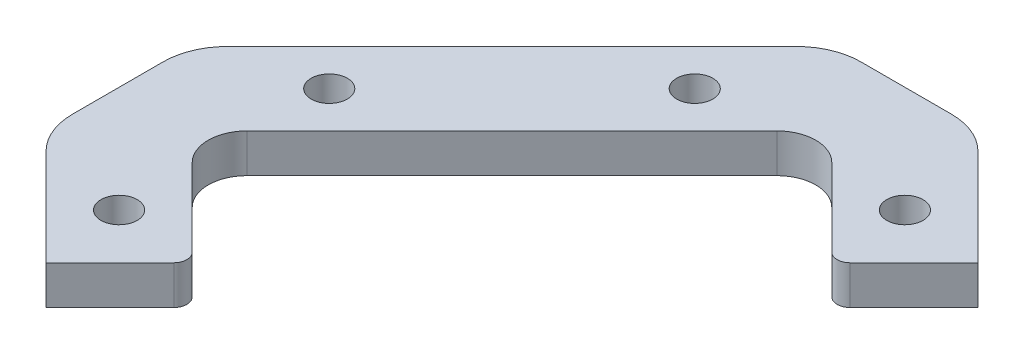
ISO-10303-21;
HEADER;
FILE_DESCRIPTION(('STEP AP214'),'2;1');
FILE_NAME('part.step','',(''),(''),'','','');
FILE_SCHEMA(('AUTOMOTIVE_DESIGN { 1 0 10303 214 1 1 1 1 }'));
ENDSEC;
DATA;
#1=APPLICATION_CONTEXT('core data for automotive mechanical design processes');
#2=APPLICATION_PROTOCOL_DEFINITION('international standard','automotive_design',2000,#1);
#3=PRODUCT_CONTEXT('',#1,'mechanical');
#4=PRODUCT('Part','Part','',(#3));
#5=PRODUCT_RELATED_PRODUCT_CATEGORY('part','',(#4));
#6=PRODUCT_DEFINITION_FORMATION('','',#4);
#7=PRODUCT_DEFINITION_CONTEXT('part definition',#1,'design');
#8=PRODUCT_DEFINITION('design','',#6,#7);
#9=PRODUCT_DEFINITION_SHAPE('','',#8);
#10=(LENGTH_UNIT() NAMED_UNIT(*) SI_UNIT(.MILLI.,.METRE.));
#11=(NAMED_UNIT(*) PLANE_ANGLE_UNIT() SI_UNIT($,.RADIAN.));
#12=(NAMED_UNIT(*) SI_UNIT($,.STERADIAN.) SOLID_ANGLE_UNIT());
#13=UNCERTAINTY_MEASURE_WITH_UNIT(LENGTH_MEASURE(1.E-05),#10,'distance_accuracy_value','');
#14=(GEOMETRIC_REPRESENTATION_CONTEXT(3) GLOBAL_UNCERTAINTY_ASSIGNED_CONTEXT((#13)) GLOBAL_UNIT_ASSIGNED_CONTEXT((#10,
#11,#12)) REPRESENTATION_CONTEXT('',''));
#15=CARTESIAN_POINT('',(0.,0.,0.));
#16=DIRECTION('',(0.,0.,1.));
#17=DIRECTION('',(1.,0.,0.));
#18=AXIS2_PLACEMENT_3D('',#15,#16,#17);
#19=CARTESIAN_POINT('',(-6.74456057212033,3.,14.6317901941447));
#20=DIRECTION('',(0.,1.,0.));
#21=DIRECTION('',(0.,0.,1.));
#22=AXIS2_PLACEMENT_3D('',#19,#20,#21);
#23=PLANE('',#22);
#24=CARTESIAN_POINT('',(-11.6943080404259,3.,-2.33877255433241));
#25=DIRECTION('',(0.,1.,0.));
#26=DIRECTION('',(0.,0.,1.));
#27=AXIS2_PLACEMENT_3D('',#24,#25,#26);
#28=CIRCLE('',#27,1.4);
#29=CARTESIAN_POINT('',(-11.6943080404259,3.,-0.938772554332412));
#30=VERTEX_POINT('',#29);
#31=EDGE_CURVE('E434',#30,#30,#28,.T.);
#32=ORIENTED_EDGE('',*,*,#31,.F.);
#33=EDGE_LOOP('',(#32));
#34=FACE_BOUND('',#33,.T.);
#35=CARTESIAN_POINT('',(18.7112835505958,3.,-16.480908178063));
#36=DIRECTION('',(0.,1.,0.));
#37=DIRECTION('',(0.,0.,1.));
#38=AXIS2_PLACEMENT_3D('',#35,#36,#37);
#39=CIRCLE('',#38,1.4);
#40=CARTESIAN_POINT('',(18.7112835505958,3.,-15.080908178063));
#41=VERTEX_POINT('',#40);
#42=EDGE_CURVE('E212',#41,#41,#39,.T.);
#43=ORIENTED_EDGE('',*,*,#42,.F.);
#44=EDGE_LOOP('',(#43));
#45=FACE_BOUND('',#44,.T.);
#46=CARTESIAN_POINT('',(-6.74456057212033,3.,14.6317901941447));
#47=DIRECTION('',(0.,1.,0.));
#48=DIRECTION('',(0.,0.,1.));
#49=AXIS2_PLACEMENT_3D('',#46,#47,#48);
#50=CIRCLE('',#49,0.999999999999965);
#51=CARTESIAN_POINT('',(-6.03745379093385,3.,15.3388969753312));
#52=VERTEX_POINT('',#51);
#53=CARTESIAN_POINT('',(-6.03745379093376,3.,13.9246834129581));
#54=VERTEX_POINT('',#53);
#55=EDGE_CURVE('E260',#52,#54,#50,.T.);
#56=ORIENTED_EDGE('',*,*,#55,.T.);
#57=DIRECTION('',(-0.707106781186548,0.,-0.707106781186548));
#58=VECTOR('',#57,1.);
#59=CARTESIAN_POINT('',(-6.03745379093376,3.,13.9246834129581));
#60=LINE('',#59,#58);
#61=CARTESIAN_POINT('',(-12.0478614310193,3.,7.91427577287255));
#62=VERTEX_POINT('',#61);
#63=EDGE_CURVE('E136',#54,#62,#60,.T.);
#64=ORIENTED_EDGE('',*,*,#63,.T.);
#65=CARTESIAN_POINT('',(-9.92654108745964,3.,5.7929554293129));
#66=DIRECTION('',(0.,-1.,0.));
#67=DIRECTION('',(0.,0.,1.));
#68=AXIS2_PLACEMENT_3D('',#65,#66,#67);
#69=CIRCLE('',#68,3.);
#70=CARTESIAN_POINT('',(-12.0478614310193,3.,3.67163508575328));
#71=VERTEX_POINT('',#70);
#72=EDGE_CURVE('E321',#62,#71,#69,.T.);
#73=ORIENTED_EDGE('',*,*,#72,.T.);
#74=DIRECTION('',(0.707106781186547,0.,-0.707106781186547));
#75=VECTOR('',#74,1.);
#76=CARTESIAN_POINT('',(-12.0478614310193,3.,3.67163508575328));
#77=LINE('',#76,#75);
#78=CARTESIAN_POINT('',(8.45823522339074,3.,-16.8344615686565));
#79=VERTEX_POINT('',#78);
#80=EDGE_CURVE('E341',#71,#79,#77,.T.);
#81=ORIENTED_EDGE('',*,*,#80,.T.);
#82=CARTESIAN_POINT('',(10.5795555669505,3.,-14.7131412250968));
#83=DIRECTION('',(0.,-1.,0.));
#84=DIRECTION('',(0.,0.,1.));
#85=AXIS2_PLACEMENT_3D('',#82,#83,#84);
#86=CIRCLE('',#85,3.00000000000011);
#87=CARTESIAN_POINT('',(12.7008759105101,3.,-16.8344615686564));
#88=VERTEX_POINT('',#87);
#89=EDGE_CURVE('E337',#79,#88,#86,.T.);
#90=ORIENTED_EDGE('',*,*,#89,.T.);
#91=DIRECTION('',(0.707106781186548,0.,0.707106781186548));
#92=VECTOR('',#91,1.);
#93=CARTESIAN_POINT('',(12.7008759105101,3.,-16.8344615686564));
#94=LINE('',#93,#92);
#95=CARTESIAN_POINT('',(18.7112835505957,3.,-10.8240539285707));
#96=VERTEX_POINT('',#95);
#97=EDGE_CURVE('E340',#88,#96,#94,.T.);
#98=ORIENTED_EDGE('',*,*,#97,.T.);
#99=CARTESIAN_POINT('',(19.4183903317823,3.,-11.5311607097572));
#100=DIRECTION('',(0.,1.,0.));
#101=DIRECTION('',(0.,0.,1.));
#102=AXIS2_PLACEMENT_3D('',#99,#100,#101);
#103=CIRCLE('',#102,0.999999999999948);
#104=CARTESIAN_POINT('',(20.1254971129688,3.,-10.8240539285707));
#105=VERTEX_POINT('',#104);
#106=EDGE_CURVE('E345',#96,#105,#103,.T.);
#107=ORIENTED_EDGE('',*,*,#106,.T.);
#108=DIRECTION('',(0.707106781186548,0.,-0.707106781186547));
#109=VECTOR('',#108,1.);
#110=CARTESIAN_POINT('',(20.1254971129688,3.,-10.8240539285707));
#111=LINE('',#110,#109);
#112=CARTESIAN_POINT('',(25.0752445812746,3.,-15.7738013968765));
#113=VERTEX_POINT('',#112);
#114=EDGE_CURVE('E352',#105,#113,#111,.T.);
#115=ORIENTED_EDGE('',*,*,#114,.T.);
#116=DIRECTION('',(-0.707106781186547,0.,-0.707106781186547));
#117=VECTOR('',#116,1.);
#118=CARTESIAN_POINT('',(25.0752445812746,3.,-15.7738013968765));
#119=LINE('',#118,#117);
#120=CARTESIAN_POINT('',(17.6064675015317,3.,-23.2425784766195));
#121=VERTEX_POINT('',#120);
#122=EDGE_CURVE('E355',#113,#121,#119,.T.);
#123=ORIENTED_EDGE('',*,*,#122,.T.);
#124=CARTESIAN_POINT('',(14.070933595599,3.,-19.7070445706869));
#125=DIRECTION('',(0.,1.,0.));
#126=DIRECTION('',(0.,0.,1.));
#127=AXIS2_PLACEMENT_3D('',#124,#125,#126);
#128=CIRCLE('',#127,4.99999999999992);
#129=CARTESIAN_POINT('',(14.070933595599,3.,-24.7070445706869));
#130=VERTEX_POINT('',#129);
#131=EDGE_CURVE('E358',#121,#130,#128,.T.);
#132=ORIENTED_EDGE('',*,*,#131,.T.);
#133=DIRECTION('',(-1.,0.,0.));
#134=VECTOR('',#133,1.);
#135=CARTESIAN_POINT('',(14.070933595599,3.,-24.7070445706869));
#136=LINE('',#135,#134);
#137=CARTESIAN_POINT('',(7.08817753830206,3.,-24.7070445706869));
#138=VERTEX_POINT('',#137);
#139=EDGE_CURVE('E361',#130,#138,#136,.T.);
#140=ORIENTED_EDGE('',*,*,#139,.T.);
#141=CARTESIAN_POINT('',(7.08817753830201,3.,-19.7070445706869));
#142=DIRECTION('',(0.,1.,0.));
#143=DIRECTION('',(0.,0.,1.));
#144=AXIS2_PLACEMENT_3D('',#141,#142,#143);
#145=CIRCLE('',#144,4.99999999999995);
#146=CARTESIAN_POINT('',(3.5526436323693,3.,-23.2425784766196));
#147=VERTEX_POINT('',#146);
#148=EDGE_CURVE('E364',#138,#147,#145,.T.);
#149=ORIENTED_EDGE('',*,*,#148,.T.);
#150=DIRECTION('',(-0.707106781186547,0.,0.707106781186547));
#151=VECTOR('',#150,1.);
#152=CARTESIAN_POINT('',(3.5526436323693,3.,-23.2425784766196));
#153=LINE('',#152,#151);
#154=CARTESIAN_POINT('',(-18.4559783389823,3.,-1.23395650526831));
#155=VERTEX_POINT('',#154);
#156=EDGE_CURVE('E367',#147,#155,#153,.T.);
#157=ORIENTED_EDGE('',*,*,#156,.T.);
#158=CARTESIAN_POINT('',(-14.9204444330497,3.,2.30157740066436));
#159=DIRECTION('',(0.,1.,0.));
#160=DIRECTION('',(0.,0.,1.));
#161=AXIS2_PLACEMENT_3D('',#158,#159,#160);
#162=CIRCLE('',#161,4.99999999999983);
#163=CARTESIAN_POINT('',(-19.9204444330497,3.,2.30157740066436));
#164=VERTEX_POINT('',#163);
#165=EDGE_CURVE('E370',#155,#164,#162,.T.);
#166=ORIENTED_EDGE('',*,*,#165,.T.);
#167=DIRECTION('',(0.,0.,1.));
#168=VECTOR('',#167,1.);
#169=CARTESIAN_POINT('',(-19.9204444330497,3.,2.30157740066436));
#170=LINE('',#169,#168);
#171=CARTESIAN_POINT('',(-19.9204444330497,3.,9.28433345796131));
#172=VERTEX_POINT('',#171);
#173=EDGE_CURVE('E185',#164,#172,#170,.T.);
#174=ORIENTED_EDGE('',*,*,#173,.T.);
#175=CARTESIAN_POINT('',(-14.9204444330498,3.,9.28433345796136));
#176=DIRECTION('',(0.,1.,0.));
#177=DIRECTION('',(0.,0.,1.));
#178=AXIS2_PLACEMENT_3D('',#175,#176,#177);
#179=CIRCLE('',#178,4.99999999999995);
#180=CARTESIAN_POINT('',(-18.4559783389825,3.,12.8198673638941));
#181=VERTEX_POINT('',#180);
#182=EDGE_CURVE('E179',#172,#181,#179,.T.);
#183=ORIENTED_EDGE('',*,*,#182,.T.);
#184=DIRECTION('',(0.707106781186548,0.,0.707106781186547));
#185=VECTOR('',#184,1.);
#186=CARTESIAN_POINT('',(-18.4559783389825,3.,12.8198673638941));
#187=LINE('',#186,#185);
#188=CARTESIAN_POINT('',(-10.9872012592396,3.,20.2886444436369));
#189=VERTEX_POINT('',#188);
#190=EDGE_CURVE('E183',#181,#189,#187,.T.);
#191=ORIENTED_EDGE('',*,*,#190,.T.);
#192=DIRECTION('',(0.707106781186547,0.,-0.707106781186547));
#193=VECTOR('',#192,1.);
#194=CARTESIAN_POINT('',(-10.9872012592396,3.,20.2886444436369));
#195=LINE('',#194,#193);
#196=EDGE_CURVE('E63',#189,#52,#195,.T.);
#197=ORIENTED_EDGE('',*,*,#196,.T.);
#198=EDGE_LOOP('',(#56,#64,#73,#81,#90,#98,#107,#115,#123,#132,#140,#149,#157,#166,#174,#183,
#191,#197));
#199=FACE_BOUND('',#198,.T.);
#200=CARTESIAN_POINT('',(2.44782758330519,3.,-16.4809081780633));
#201=DIRECTION('',(0.,1.,0.));
#202=DIRECTION('',(0.,0.,1.));
#203=AXIS2_PLACEMENT_3D('',#200,#201,#202);
#204=CIRCLE('',#203,1.4);
#205=CARTESIAN_POINT('',(2.44782758330519,3.,-15.0809081780633));
#206=VERTEX_POINT('',#205);
#207=EDGE_CURVE('E442',#206,#206,#204,.T.);
#208=ORIENTED_EDGE('',*,*,#207,.F.);
#209=EDGE_LOOP('',(#208));
#210=FACE_BOUND('',#209,.T.);
#211=CARTESIAN_POINT('',(-11.694308040426,3.,13.9246834129582));
#212=DIRECTION('',(0.,1.,0.));
#213=DIRECTION('',(0.,0.,1.));
#214=AXIS2_PLACEMENT_3D('',#211,#212,#213);
#215=CIRCLE('',#214,1.4);
#216=CARTESIAN_POINT('',(-11.694308040426,3.,15.3246834129582));
#217=VERTEX_POINT('',#216);
#218=EDGE_CURVE('E423',#217,#217,#215,.T.);
#219=ORIENTED_EDGE('',*,*,#218,.F.);
#220=EDGE_LOOP('',(#219));
#221=FACE_BOUND('',#220,.T.);
#222=ADVANCED_FACE('F45',(#34,#45,#199,#210,#221),#23,.T.);
#223=CARTESIAN_POINT('',(-6.74456057212033,0.,14.6317901941447));
#224=DIRECTION('',(0.,1.,0.));
#225=DIRECTION('',(0.,0.,1.));
#226=AXIS2_PLACEMENT_3D('',#223,#224,#225);
#227=PLANE('',#226);
#228=CARTESIAN_POINT('',(-6.74456057212033,0.,14.6317901941447));
#229=DIRECTION('',(0.,1.,0.));
#230=DIRECTION('',(0.,0.,1.));
#231=AXIS2_PLACEMENT_3D('',#228,#229,#230);
#232=CIRCLE('',#231,0.999999999999965);
#233=CARTESIAN_POINT('',(-6.03745379093385,0.,15.3388969753312));
#234=VERTEX_POINT('',#233);
#235=CARTESIAN_POINT('',(-6.03745379093376,0.,13.9246834129581));
#236=VERTEX_POINT('',#235);
#237=EDGE_CURVE('E207',#234,#236,#232,.T.);
#238=ORIENTED_EDGE('',*,*,#237,.F.);
#239=DIRECTION('',(0.707106781186547,0.,-0.707106781186547));
#240=VECTOR('',#239,1.);
#241=CARTESIAN_POINT('',(-10.9872012592396,0.,20.2886444436369));
#242=LINE('',#241,#240);
#243=CARTESIAN_POINT('',(-10.9872012592396,0.,20.2886444436369));
#244=VERTEX_POINT('',#243);
#245=EDGE_CURVE('E128',#244,#234,#242,.T.);
#246=ORIENTED_EDGE('',*,*,#245,.F.);
#247=DIRECTION('',(0.707106781186548,0.,0.707106781186547));
#248=VECTOR('',#247,1.);
#249=CARTESIAN_POINT('',(-18.4559783389825,0.,12.8198673638941));
#250=LINE('',#249,#248);
#251=CARTESIAN_POINT('',(-18.4559783389825,0.,12.8198673638941));
#252=VERTEX_POINT('',#251);
#253=EDGE_CURVE('E122',#252,#244,#250,.T.);
#254=ORIENTED_EDGE('',*,*,#253,.F.);
#255=CARTESIAN_POINT('',(-14.9204444330498,0.,9.28433345796136));
#256=DIRECTION('',(0.,1.,0.));
#257=DIRECTION('',(0.,0.,1.));
#258=AXIS2_PLACEMENT_3D('',#255,#256,#257);
#259=CIRCLE('',#258,4.99999999999995);
#260=CARTESIAN_POINT('',(-19.9204444330497,0.,9.28433345796131));
#261=VERTEX_POINT('',#260);
#262=EDGE_CURVE('E194',#261,#252,#259,.T.);
#263=ORIENTED_EDGE('',*,*,#262,.F.);
#264=DIRECTION('',(0.,0.,1.));
#265=VECTOR('',#264,1.);
#266=CARTESIAN_POINT('',(-19.9204444330497,0.,2.30157740066436));
#267=LINE('',#266,#265);
#268=CARTESIAN_POINT('',(-19.9204444330497,0.,2.30157740066436));
#269=VERTEX_POINT('',#268);
#270=EDGE_CURVE('E251',#269,#261,#267,.T.);
#271=ORIENTED_EDGE('',*,*,#270,.F.);
#272=CARTESIAN_POINT('',(-14.9204444330497,0.,2.30157740066436));
#273=DIRECTION('',(0.,1.,0.));
#274=DIRECTION('',(0.,0.,1.));
#275=AXIS2_PLACEMENT_3D('',#272,#273,#274);
#276=CIRCLE('',#275,4.99999999999983);
#277=CARTESIAN_POINT('',(-18.4559783389823,0.,-1.23395650526831));
#278=VERTEX_POINT('',#277);
#279=EDGE_CURVE('E248',#278,#269,#276,.T.);
#280=ORIENTED_EDGE('',*,*,#279,.F.);
#281=DIRECTION('',(-0.707106781186547,0.,0.707106781186547));
#282=VECTOR('',#281,1.);
#283=CARTESIAN_POINT('',(3.5526436323693,0.,-23.2425784766196));
#284=LINE('',#283,#282);
#285=CARTESIAN_POINT('',(3.5526436323693,0.,-23.2425784766196));
#286=VERTEX_POINT('',#285);
#287=EDGE_CURVE('E245',#286,#278,#284,.T.);
#288=ORIENTED_EDGE('',*,*,#287,.F.);
#289=CARTESIAN_POINT('',(7.08817753830201,0.,-19.7070445706869));
#290=DIRECTION('',(0.,1.,0.));
#291=DIRECTION('',(0.,0.,1.));
#292=AXIS2_PLACEMENT_3D('',#289,#290,#291);
#293=CIRCLE('',#292,4.99999999999995);
#294=CARTESIAN_POINT('',(7.08817753830206,0.,-24.7070445706869));
#295=VERTEX_POINT('',#294);
#296=EDGE_CURVE('E242',#295,#286,#293,.T.);
#297=ORIENTED_EDGE('',*,*,#296,.F.);
#298=DIRECTION('',(-1.,0.,0.));
#299=VECTOR('',#298,1.);
#300=CARTESIAN_POINT('',(14.070933595599,0.,-24.7070445706869));
#301=LINE('',#300,#299);
#302=CARTESIAN_POINT('',(14.070933595599,0.,-24.7070445706869));
#303=VERTEX_POINT('',#302);
#304=EDGE_CURVE('E239',#303,#295,#301,.T.);
#305=ORIENTED_EDGE('',*,*,#304,.F.);
#306=CARTESIAN_POINT('',(14.070933595599,0.,-19.7070445706869));
#307=DIRECTION('',(0.,1.,0.));
#308=DIRECTION('',(0.,0.,1.));
#309=AXIS2_PLACEMENT_3D('',#306,#307,#308);
#310=CIRCLE('',#309,4.99999999999992);
#311=CARTESIAN_POINT('',(17.6064675015317,0.,-23.2425784766195));
#312=VERTEX_POINT('',#311);
#313=EDGE_CURVE('E236',#312,#303,#310,.T.);
#314=ORIENTED_EDGE('',*,*,#313,.F.);
#315=DIRECTION('',(-0.707106781186547,0.,-0.707106781186547));
#316=VECTOR('',#315,1.);
#317=CARTESIAN_POINT('',(25.0752445812746,0.,-15.7738013968765));
#318=LINE('',#317,#316);
#319=CARTESIAN_POINT('',(25.0752445812746,0.,-15.7738013968765));
#320=VERTEX_POINT('',#319);
#321=EDGE_CURVE('E233',#320,#312,#318,.T.);
#322=ORIENTED_EDGE('',*,*,#321,.F.);
#323=DIRECTION('',(0.707106781186548,0.,-0.707106781186547));
#324=VECTOR('',#323,1.);
#325=CARTESIAN_POINT('',(20.1254971129688,0.,-10.8240539285707));
#326=LINE('',#325,#324);
#327=CARTESIAN_POINT('',(20.1254971129688,0.,-10.8240539285707));
#328=VERTEX_POINT('',#327);
#329=EDGE_CURVE('E230',#328,#320,#326,.T.);
#330=ORIENTED_EDGE('',*,*,#329,.F.);
#331=CARTESIAN_POINT('',(19.4183903317823,0.,-11.5311607097572));
#332=DIRECTION('',(0.,1.,0.));
#333=DIRECTION('',(0.,0.,1.));
#334=AXIS2_PLACEMENT_3D('',#331,#332,#333);
#335=CIRCLE('',#334,0.999999999999948);
#336=CARTESIAN_POINT('',(18.7112835505957,0.,-10.8240539285707));
#337=VERTEX_POINT('',#336);
#338=EDGE_CURVE('E227',#337,#328,#335,.T.);
#339=ORIENTED_EDGE('',*,*,#338,.F.);
#340=DIRECTION('',(0.707106781186548,0.,0.707106781186548));
#341=VECTOR('',#340,1.);
#342=CARTESIAN_POINT('',(12.7008759105101,0.,-16.8344615686564));
#343=LINE('',#342,#341);
#344=CARTESIAN_POINT('',(12.7008759105101,0.,-16.8344615686564));
#345=VERTEX_POINT('',#344);
#346=EDGE_CURVE('E224',#345,#337,#343,.T.);
#347=ORIENTED_EDGE('',*,*,#346,.F.);
#348=CARTESIAN_POINT('',(10.5795555669505,0.,-14.7131412250968));
#349=DIRECTION('',(0.,-1.,0.));
#350=DIRECTION('',(0.,0.,1.));
#351=AXIS2_PLACEMENT_3D('',#348,#349,#350);
#352=CIRCLE('',#351,3.00000000000011);
#353=CARTESIAN_POINT('',(8.45823522339074,0.,-16.8344615686565));
#354=VERTEX_POINT('',#353);
#355=EDGE_CURVE('E221',#354,#345,#352,.T.);
#356=ORIENTED_EDGE('',*,*,#355,.F.);
#357=DIRECTION('',(0.707106781186547,0.,-0.707106781186547));
#358=VECTOR('',#357,1.);
#359=CARTESIAN_POINT('',(-12.0478614310193,0.,3.67163508575328));
#360=LINE('',#359,#358);
#361=CARTESIAN_POINT('',(-12.0478614310193,0.,3.67163508575328));
#362=VERTEX_POINT('',#361);
#363=EDGE_CURVE('E218',#362,#354,#360,.T.);
#364=ORIENTED_EDGE('',*,*,#363,.F.);
#365=CARTESIAN_POINT('',(-9.92654108745964,0.,5.7929554293129));
#366=DIRECTION('',(0.,-1.,0.));
#367=DIRECTION('',(0.,0.,1.));
#368=AXIS2_PLACEMENT_3D('',#365,#366,#367);
#369=CIRCLE('',#368,3.);
#370=CARTESIAN_POINT('',(-12.0478614310193,0.,7.91427577287255));
#371=VERTEX_POINT('',#370);
#372=EDGE_CURVE('E215',#371,#362,#369,.T.);
#373=ORIENTED_EDGE('',*,*,#372,.F.);
#374=DIRECTION('',(-0.707106781186548,0.,-0.707106781186548));
#375=VECTOR('',#374,1.);
#376=CARTESIAN_POINT('',(-6.03745379093376,0.,13.9246834129581));
#377=LINE('',#376,#375);
#378=EDGE_CURVE('E211',#236,#371,#377,.T.);
#379=ORIENTED_EDGE('',*,*,#378,.F.);
#380=EDGE_LOOP('',(#238,#246,#254,#263,#271,#280,#288,#297,#305,#314,#322,#330,#339,#347,#356,
#364,#373,#379));
#381=FACE_BOUND('',#380,.T.);
#382=CARTESIAN_POINT('',(18.7112835505958,0.,-16.480908178063));
#383=DIRECTION('',(0.,1.,0.));
#384=DIRECTION('',(0.,0.,1.));
#385=AXIS2_PLACEMENT_3D('',#382,#383,#384);
#386=CIRCLE('',#385,1.4);
#387=CARTESIAN_POINT('',(18.7112835505958,0.,-15.080908178063));
#388=VERTEX_POINT('',#387);
#389=EDGE_CURVE('E446',#388,#388,#386,.T.);
#390=ORIENTED_EDGE('',*,*,#389,.T.);
#391=EDGE_LOOP('',(#390));
#392=FACE_BOUND('',#391,.T.);
#393=CARTESIAN_POINT('',(2.44782758330519,0.,-16.4809081780633));
#394=DIRECTION('',(0.,1.,0.));
#395=DIRECTION('',(0.,0.,1.));
#396=AXIS2_PLACEMENT_3D('',#393,#394,#395);
#397=CIRCLE('',#396,1.4);
#398=CARTESIAN_POINT('',(2.44782758330519,0.,-15.0809081780633));
#399=VERTEX_POINT('',#398);
#400=EDGE_CURVE('E438',#399,#399,#397,.T.);
#401=ORIENTED_EDGE('',*,*,#400,.T.);
#402=EDGE_LOOP('',(#401));
#403=FACE_BOUND('',#402,.T.);
#404=CARTESIAN_POINT('',(-11.6943080404259,0.,-2.33877255433241));
#405=DIRECTION('',(0.,1.,0.));
#406=DIRECTION('',(0.,0.,1.));
#407=AXIS2_PLACEMENT_3D('',#404,#405,#406);
#408=CIRCLE('',#407,1.4);
#409=CARTESIAN_POINT('',(-11.6943080404259,0.,-0.938772554332412));
#410=VERTEX_POINT('',#409);
#411=EDGE_CURVE('E431',#410,#410,#408,.T.);
#412=ORIENTED_EDGE('',*,*,#411,.T.);
#413=EDGE_LOOP('',(#412));
#414=FACE_BOUND('',#413,.T.);
#415=CARTESIAN_POINT('',(-11.694308040426,0.,13.9246834129582));
#416=DIRECTION('',(0.,1.,0.));
#417=DIRECTION('',(0.,0.,1.));
#418=AXIS2_PLACEMENT_3D('',#415,#416,#417);
#419=CIRCLE('',#418,1.4);
#420=CARTESIAN_POINT('',(-11.694308040426,0.,15.3246834129582));
#421=VERTEX_POINT('',#420);
#422=EDGE_CURVE('E426',#421,#421,#419,.T.);
#423=ORIENTED_EDGE('',*,*,#422,.T.);
#424=EDGE_LOOP('',(#423));
#425=FACE_BOUND('',#424,.T.);
#426=ADVANCED_FACE('F325',(#381,#392,#403,#414,#425),#227,.F.);
#427=CARTESIAN_POINT('',(-6.74456057212033,3.,14.6317901941447));
#428=DIRECTION('',(0.,-1.,0.));
#429=DIRECTION('',(0.,0.,-1.));
#430=AXIS2_PLACEMENT_3D('',#427,#428,#429);
#431=CYLINDRICAL_SURFACE('',#430,0.999999999999965);
#432=ORIENTED_EDGE('',*,*,#237,.T.);
#433=DIRECTION('',(0.,-1.,0.));
#434=VECTOR('',#433,1.);
#435=CARTESIAN_POINT('',(-6.03745379093376,3.,13.9246834129581));
#436=LINE('',#435,#434);
#437=EDGE_CURVE('E11',#54,#236,#436,.T.);
#438=ORIENTED_EDGE('',*,*,#437,.F.);
#439=ORIENTED_EDGE('',*,*,#55,.F.);
#440=DIRECTION('',(0.,-1.,0.));
#441=VECTOR('',#440,1.);
#442=CARTESIAN_POINT('',(-6.03745379093385,3.,15.3388969753312));
#443=LINE('',#442,#441);
#444=EDGE_CURVE('E203',#52,#234,#443,.T.);
#445=ORIENTED_EDGE('',*,*,#444,.T.);
#446=EDGE_LOOP('',(#432,#438,#439,#445));
#447=FACE_BOUND('',#446,.T.);
#448=ADVANCED_FACE('F47',(#447),#431,.T.);
#449=CARTESIAN_POINT('',(-6.03745379093376,3.,13.9246834129581));
#450=DIRECTION('',(-0.707106781186547,0.,0.707106781186547));
#451=DIRECTION('',(0.707106781186548,0.,0.707106781186548));
#452=AXIS2_PLACEMENT_3D('',#449,#450,#451);
#453=PLANE('',#452);
#454=ORIENTED_EDGE('',*,*,#378,.T.);
#455=DIRECTION('',(0.,-1.,0.));
#456=VECTOR('',#455,1.);
#457=CARTESIAN_POINT('',(-12.0478614310193,3.,7.91427577287255));
#458=LINE('',#457,#456);
#459=EDGE_CURVE('E55',#62,#371,#458,.T.);
#460=ORIENTED_EDGE('',*,*,#459,.F.);
#461=ORIENTED_EDGE('',*,*,#63,.F.);
#462=ORIENTED_EDGE('',*,*,#437,.T.);
#463=EDGE_LOOP('',(#454,#460,#461,#462));
#464=FACE_BOUND('',#463,.T.);
#465=ADVANCED_FACE('F626',(#464),#453,.F.);
#466=CARTESIAN_POINT('',(-9.92654108745964,3.,5.7929554293129));
#467=DIRECTION('',(0.,-1.,0.));
#468=DIRECTION('',(0.,0.,-1.));
#469=AXIS2_PLACEMENT_3D('',#466,#467,#468);
#470=CYLINDRICAL_SURFACE('',#469,3.);
#471=ORIENTED_EDGE('',*,*,#372,.T.);
#472=DIRECTION('',(0.,-1.,0.));
#473=VECTOR('',#472,1.);
#474=CARTESIAN_POINT('',(-12.0478614310193,3.,3.67163508575328));
#475=LINE('',#474,#473);
#476=EDGE_CURVE('E311',#71,#362,#475,.T.);
#477=ORIENTED_EDGE('',*,*,#476,.F.);
#478=ORIENTED_EDGE('',*,*,#72,.F.);
#479=ORIENTED_EDGE('',*,*,#459,.T.);
#480=EDGE_LOOP('',(#471,#477,#478,#479));
#481=FACE_BOUND('',#480,.T.);
#482=ADVANCED_FACE('F319',(#481),#470,.F.);
#483=CARTESIAN_POINT('',(-12.0478614310193,3.,3.67163508575328));
#484=DIRECTION('',(-0.707106781186548,0.,-0.707106781186548));
#485=DIRECTION('',(-0.707106781186548,0.,0.707106781186548));
#486=AXIS2_PLACEMENT_3D('',#483,#484,#485);
#487=PLANE('',#486);
#488=ORIENTED_EDGE('',*,*,#363,.T.);
#489=DIRECTION('',(0.,-1.,0.));
#490=VECTOR('',#489,1.);
#491=CARTESIAN_POINT('',(8.45823522339074,3.,-16.8344615686565));
#492=LINE('',#491,#490);
#493=EDGE_CURVE('E307',#79,#354,#492,.T.);
#494=ORIENTED_EDGE('',*,*,#493,.F.);
#495=ORIENTED_EDGE('',*,*,#80,.F.);
#496=ORIENTED_EDGE('',*,*,#476,.T.);
#497=EDGE_LOOP('',(#488,#494,#495,#496));
#498=FACE_BOUND('',#497,.T.);
#499=ADVANCED_FACE('F331',(#498),#487,.F.);
#500=CARTESIAN_POINT('',(10.5795555669505,3.,-14.7131412250968));
#501=DIRECTION('',(0.,-1.,0.));
#502=DIRECTION('',(0.,0.,-1.));
#503=AXIS2_PLACEMENT_3D('',#500,#501,#502);
#504=CYLINDRICAL_SURFACE('',#503,3.00000000000011);
#505=ORIENTED_EDGE('',*,*,#355,.T.);
#506=DIRECTION('',(0.,-1.,0.));
#507=VECTOR('',#506,1.);
#508=CARTESIAN_POINT('',(12.7008759105101,3.,-16.8344615686564));
#509=LINE('',#508,#507);
#510=EDGE_CURVE('E303',#88,#345,#509,.T.);
#511=ORIENTED_EDGE('',*,*,#510,.F.);
#512=ORIENTED_EDGE('',*,*,#89,.F.);
#513=ORIENTED_EDGE('',*,*,#493,.T.);
#514=EDGE_LOOP('',(#505,#511,#512,#513));
#515=FACE_BOUND('',#514,.T.);
#516=ADVANCED_FACE('F335',(#515),#504,.F.);
#517=CARTESIAN_POINT('',(12.7008759105101,3.,-16.8344615686564));
#518=DIRECTION('',(0.707106781186547,0.,-0.707106781186547));
#519=DIRECTION('',(-0.707106781186548,0.,-0.707106781186548));
#520=AXIS2_PLACEMENT_3D('',#517,#518,#519);
#521=PLANE('',#520);
#522=ORIENTED_EDGE('',*,*,#346,.T.);
#523=DIRECTION('',(0.,-1.,0.));
#524=VECTOR('',#523,1.);
#525=CARTESIAN_POINT('',(18.7112835505957,3.,-10.8240539285707));
#526=LINE('',#525,#524);
#527=EDGE_CURVE('E299',#96,#337,#526,.T.);
#528=ORIENTED_EDGE('',*,*,#527,.F.);
#529=ORIENTED_EDGE('',*,*,#97,.F.);
#530=ORIENTED_EDGE('',*,*,#510,.T.);
#531=EDGE_LOOP('',(#522,#528,#529,#530));
#532=FACE_BOUND('',#531,.T.);
#533=ADVANCED_FACE('F591',(#532),#521,.F.);
#534=CARTESIAN_POINT('',(19.4183903317823,3.,-11.5311607097572));
#535=DIRECTION('',(0.,-1.,0.));
#536=DIRECTION('',(0.,0.,-1.));
#537=AXIS2_PLACEMENT_3D('',#534,#535,#536);
#538=CYLINDRICAL_SURFACE('',#537,0.999999999999948);
#539=ORIENTED_EDGE('',*,*,#338,.T.);
#540=DIRECTION('',(0.,-1.,0.));
#541=VECTOR('',#540,1.);
#542=CARTESIAN_POINT('',(20.1254971129688,3.,-10.8240539285707));
#543=LINE('',#542,#541);
#544=EDGE_CURVE('E295',#105,#328,#543,.T.);
#545=ORIENTED_EDGE('',*,*,#544,.F.);
#546=ORIENTED_EDGE('',*,*,#106,.F.);
#547=ORIENTED_EDGE('',*,*,#527,.T.);
#548=EDGE_LOOP('',(#539,#545,#546,#547));
#549=FACE_BOUND('',#548,.T.);
#550=ADVANCED_FACE('F581',(#549),#538,.T.);
#551=CARTESIAN_POINT('',(20.1254971129688,3.,-10.8240539285707));
#552=DIRECTION('',(-0.707106781186547,0.,-0.707106781186548));
#553=DIRECTION('',(-0.707106781186548,0.,0.707106781186547));
#554=AXIS2_PLACEMENT_3D('',#551,#552,#553);
#555=PLANE('',#554);
#556=ORIENTED_EDGE('',*,*,#329,.T.);
#557=DIRECTION('',(0.,-1.,0.));
#558=VECTOR('',#557,1.);
#559=CARTESIAN_POINT('',(25.0752445812746,3.,-15.7738013968765));
#560=LINE('',#559,#558);
#561=EDGE_CURVE('E291',#113,#320,#560,.T.);
#562=ORIENTED_EDGE('',*,*,#561,.F.);
#563=ORIENTED_EDGE('',*,*,#114,.F.);
#564=ORIENTED_EDGE('',*,*,#544,.T.);
#565=EDGE_LOOP('',(#556,#562,#563,#564));
#566=FACE_BOUND('',#565,.T.);
#567=ADVANCED_FACE('F571',(#566),#555,.F.);
#568=CARTESIAN_POINT('',(25.0752445812746,3.,-15.7738013968765));
#569=DIRECTION('',(-0.707106781186548,0.,0.707106781186548));
#570=DIRECTION('',(0.707106781186548,0.,0.707106781186548));
#571=AXIS2_PLACEMENT_3D('',#568,#569,#570);
#572=PLANE('',#571);
#573=ORIENTED_EDGE('',*,*,#321,.T.);
#574=DIRECTION('',(0.,-1.,0.));
#575=VECTOR('',#574,1.);
#576=CARTESIAN_POINT('',(17.6064675015317,3.,-23.2425784766195));
#577=LINE('',#576,#575);
#578=EDGE_CURVE('E287',#121,#312,#577,.T.);
#579=ORIENTED_EDGE('',*,*,#578,.F.);
#580=ORIENTED_EDGE('',*,*,#122,.F.);
#581=ORIENTED_EDGE('',*,*,#561,.T.);
#582=EDGE_LOOP('',(#573,#579,#580,#581));
#583=FACE_BOUND('',#582,.T.);
#584=ADVANCED_FACE('F561',(#583),#572,.F.);
#585=CARTESIAN_POINT('',(14.070933595599,3.,-19.7070445706869));
#586=DIRECTION('',(0.,-1.,0.));
#587=DIRECTION('',(0.,0.,-1.));
#588=AXIS2_PLACEMENT_3D('',#585,#586,#587);
#589=CYLINDRICAL_SURFACE('',#588,4.99999999999992);
#590=ORIENTED_EDGE('',*,*,#313,.T.);
#591=DIRECTION('',(0.,-1.,0.));
#592=VECTOR('',#591,1.);
#593=CARTESIAN_POINT('',(14.070933595599,3.,-24.7070445706869));
#594=LINE('',#593,#592);
#595=EDGE_CURVE('E283',#130,#303,#594,.T.);
#596=ORIENTED_EDGE('',*,*,#595,.F.);
#597=ORIENTED_EDGE('',*,*,#131,.F.);
#598=ORIENTED_EDGE('',*,*,#578,.T.);
#599=EDGE_LOOP('',(#590,#596,#597,#598));
#600=FACE_BOUND('',#599,.T.);
#601=ADVANCED_FACE('F551',(#600),#589,.T.);
#602=CARTESIAN_POINT('',(14.070933595599,3.,-24.7070445706869));
#603=DIRECTION('',(0.,0.,1.));
#604=DIRECTION('',(1.,0.,0.));
#605=AXIS2_PLACEMENT_3D('',#602,#603,#604);
#606=PLANE('',#605);
#607=ORIENTED_EDGE('',*,*,#304,.T.);
#608=DIRECTION('',(0.,-1.,0.));
#609=VECTOR('',#608,1.);
#610=CARTESIAN_POINT('',(7.08817753830206,3.,-24.7070445706869));
#611=LINE('',#610,#609);
#612=EDGE_CURVE('E279',#138,#295,#611,.T.);
#613=ORIENTED_EDGE('',*,*,#612,.F.);
#614=ORIENTED_EDGE('',*,*,#139,.F.);
#615=ORIENTED_EDGE('',*,*,#595,.T.);
#616=EDGE_LOOP('',(#607,#613,#614,#615));
#617=FACE_BOUND('',#616,.T.);
#618=ADVANCED_FACE('F541',(#617),#606,.F.);
#619=CARTESIAN_POINT('',(7.08817753830201,3.,-19.7070445706869));
#620=DIRECTION('',(0.,-1.,0.));
#621=DIRECTION('',(0.,0.,-1.));
#622=AXIS2_PLACEMENT_3D('',#619,#620,#621);
#623=CYLINDRICAL_SURFACE('',#622,4.99999999999995);
#624=ORIENTED_EDGE('',*,*,#296,.T.);
#625=DIRECTION('',(0.,-1.,0.));
#626=VECTOR('',#625,1.);
#627=CARTESIAN_POINT('',(3.5526436323693,3.,-23.2425784766196));
#628=LINE('',#627,#626);
#629=EDGE_CURVE('E275',#147,#286,#628,.T.);
#630=ORIENTED_EDGE('',*,*,#629,.F.);
#631=ORIENTED_EDGE('',*,*,#148,.F.);
#632=ORIENTED_EDGE('',*,*,#612,.T.);
#633=EDGE_LOOP('',(#624,#630,#631,#632));
#634=FACE_BOUND('',#633,.T.);
#635=ADVANCED_FACE('F531',(#634),#623,.T.);
#636=CARTESIAN_POINT('',(3.5526436323693,3.,-23.2425784766196));
#637=DIRECTION('',(0.707106781186548,0.,0.707106781186548));
#638=DIRECTION('',(0.707106781186548,0.,-0.707106781186548));
#639=AXIS2_PLACEMENT_3D('',#636,#637,#638);
#640=PLANE('',#639);
#641=ORIENTED_EDGE('',*,*,#287,.T.);
#642=DIRECTION('',(0.,-1.,0.));
#643=VECTOR('',#642,1.);
#644=CARTESIAN_POINT('',(-18.4559783389823,3.,-1.23395650526831));
#645=LINE('',#644,#643);
#646=EDGE_CURVE('E271',#155,#278,#645,.T.);
#647=ORIENTED_EDGE('',*,*,#646,.F.);
#648=ORIENTED_EDGE('',*,*,#156,.F.);
#649=ORIENTED_EDGE('',*,*,#629,.T.);
#650=EDGE_LOOP('',(#641,#647,#648,#649));
#651=FACE_BOUND('',#650,.T.);
#652=ADVANCED_FACE('F522',(#651),#640,.F.);
#653=CARTESIAN_POINT('',(-14.9204444330497,3.,2.30157740066436));
#654=DIRECTION('',(0.,-1.,0.));
#655=DIRECTION('',(0.,0.,-1.));
#656=AXIS2_PLACEMENT_3D('',#653,#654,#655);
#657=CYLINDRICAL_SURFACE('',#656,4.99999999999983);
#658=ORIENTED_EDGE('',*,*,#279,.T.);
#659=DIRECTION('',(0.,-1.,0.));
#660=VECTOR('',#659,1.);
#661=CARTESIAN_POINT('',(-19.9204444330497,3.,2.30157740066436));
#662=LINE('',#661,#660);
#663=EDGE_CURVE('E267',#164,#269,#662,.T.);
#664=ORIENTED_EDGE('',*,*,#663,.F.);
#665=ORIENTED_EDGE('',*,*,#165,.F.);
#666=ORIENTED_EDGE('',*,*,#646,.T.);
#667=EDGE_LOOP('',(#658,#664,#665,#666));
#668=FACE_BOUND('',#667,.T.);
#669=ADVANCED_FACE('F378',(#668),#657,.T.);
#670=CARTESIAN_POINT('',(-19.9204444330497,3.,2.30157740066436));
#671=DIRECTION('',(1.,0.,0.));
#672=DIRECTION('',(0.,0.,-1.));
#673=AXIS2_PLACEMENT_3D('',#670,#671,#672);
#674=PLANE('',#673);
#675=ORIENTED_EDGE('',*,*,#270,.T.);
#676=DIRECTION('',(0.,-1.,0.));
#677=VECTOR('',#676,1.);
#678=CARTESIAN_POINT('',(-19.9204444330497,3.,9.28433345796131));
#679=LINE('',#678,#677);
#680=EDGE_CURVE('E196',#172,#261,#679,.T.);
#681=ORIENTED_EDGE('',*,*,#680,.F.);
#682=ORIENTED_EDGE('',*,*,#173,.F.);
#683=ORIENTED_EDGE('',*,*,#663,.T.);
#684=EDGE_LOOP('',(#675,#681,#682,#683));
#685=FACE_BOUND('',#684,.T.);
#686=ADVANCED_FACE('F382',(#685),#674,.F.);
#687=CARTESIAN_POINT('',(-14.9204444330498,3.,9.28433345796136));
#688=DIRECTION('',(0.,-1.,0.));
#689=DIRECTION('',(0.,0.,-1.));
#690=AXIS2_PLACEMENT_3D('',#687,#688,#689);
#691=CYLINDRICAL_SURFACE('',#690,4.99999999999995);
#692=ORIENTED_EDGE('',*,*,#262,.T.);
#693=DIRECTION('',(0.,-1.,0.));
#694=VECTOR('',#693,1.);
#695=CARTESIAN_POINT('',(-18.4559783389825,3.,12.8198673638941));
#696=LINE('',#695,#694);
#697=EDGE_CURVE('E191',#181,#252,#696,.T.);
#698=ORIENTED_EDGE('',*,*,#697,.F.);
#699=ORIENTED_EDGE('',*,*,#182,.F.);
#700=ORIENTED_EDGE('',*,*,#680,.T.);
#701=EDGE_LOOP('',(#692,#698,#699,#700));
#702=FACE_BOUND('',#701,.T.);
#703=ADVANCED_FACE('F192',(#702),#691,.T.);
#704=CARTESIAN_POINT('',(-18.4559783389825,3.,12.8198673638941));
#705=DIRECTION('',(0.707106781186547,0.,-0.707106781186548));
#706=DIRECTION('',(-0.707106781186548,0.,-0.707106781186547));
#707=AXIS2_PLACEMENT_3D('',#704,#705,#706);
#708=PLANE('',#707);
#709=ORIENTED_EDGE('',*,*,#253,.T.);
#710=DIRECTION('',(0.,-1.,0.));
#711=VECTOR('',#710,1.);
#712=CARTESIAN_POINT('',(-10.9872012592396,3.,20.2886444436369));
#713=LINE('',#712,#711);
#714=EDGE_CURVE('E197',#189,#244,#713,.T.);
#715=ORIENTED_EDGE('',*,*,#714,.F.);
#716=ORIENTED_EDGE('',*,*,#190,.F.);
#717=ORIENTED_EDGE('',*,*,#697,.T.);
#718=EDGE_LOOP('',(#709,#715,#716,#717));
#719=FACE_BOUND('',#718,.T.);
#720=ADVANCED_FACE('F199',(#719),#708,.F.);
#721=CARTESIAN_POINT('',(-10.9872012592396,3.,20.2886444436369));
#722=DIRECTION('',(-0.707106781186548,0.,-0.707106781186548));
#723=DIRECTION('',(-0.707106781186548,0.,0.707106781186548));
#724=AXIS2_PLACEMENT_3D('',#721,#722,#723);
#725=PLANE('',#724);
#726=ORIENTED_EDGE('',*,*,#245,.T.);
#727=ORIENTED_EDGE('',*,*,#444,.F.);
#728=ORIENTED_EDGE('',*,*,#196,.F.);
#729=ORIENTED_EDGE('',*,*,#714,.T.);
#730=EDGE_LOOP('',(#726,#727,#728,#729));
#731=FACE_BOUND('',#730,.T.);
#732=ADVANCED_FACE('F386',(#731),#725,.F.);
#733=CARTESIAN_POINT('',(18.7112835505958,3.,-16.480908178063));
#734=DIRECTION('',(0.,-1.,0.));
#735=DIRECTION('',(0.,0.,-1.));
#736=AXIS2_PLACEMENT_3D('',#733,#734,#735);
#737=CYLINDRICAL_SURFACE('',#736,1.4);
#738=ORIENTED_EDGE('',*,*,#42,.T.);
#739=EDGE_LOOP('',(#738));
#740=FACE_BOUND('',#739,.T.);
#741=ORIENTED_EDGE('',*,*,#389,.F.);
#742=EDGE_LOOP('',(#741));
#743=FACE_BOUND('',#742,.T.);
#744=ADVANCED_FACE('F388',(#740,#743),#737,.F.);
#745=CARTESIAN_POINT('',(2.44782758330519,3.,-16.4809081780633));
#746=DIRECTION('',(0.,-1.,0.));
#747=DIRECTION('',(0.,0.,-1.));
#748=AXIS2_PLACEMENT_3D('',#745,#746,#747);
#749=CYLINDRICAL_SURFACE('',#748,1.4);
#750=ORIENTED_EDGE('',*,*,#207,.T.);
#751=EDGE_LOOP('',(#750));
#752=FACE_BOUND('',#751,.T.);
#753=ORIENTED_EDGE('',*,*,#400,.F.);
#754=EDGE_LOOP('',(#753));
#755=FACE_BOUND('',#754,.T.);
#756=ADVANCED_FACE('F394',(#752,#755),#749,.F.);
#757=CARTESIAN_POINT('',(-11.6943080404259,3.,-2.33877255433241));
#758=DIRECTION('',(0.,-1.,0.));
#759=DIRECTION('',(0.,0.,-1.));
#760=AXIS2_PLACEMENT_3D('',#757,#758,#759);
#761=CYLINDRICAL_SURFACE('',#760,1.4);
#762=ORIENTED_EDGE('',*,*,#31,.T.);
#763=EDGE_LOOP('',(#762));
#764=FACE_BOUND('',#763,.T.);
#765=ORIENTED_EDGE('',*,*,#411,.F.);
#766=EDGE_LOOP('',(#765));
#767=FACE_BOUND('',#766,.T.);
#768=ADVANCED_FACE('F410',(#764,#767),#761,.F.);
#769=CARTESIAN_POINT('',(-11.694308040426,3.,13.9246834129582));
#770=DIRECTION('',(0.,-1.,0.));
#771=DIRECTION('',(0.,0.,-1.));
#772=AXIS2_PLACEMENT_3D('',#769,#770,#771);
#773=CYLINDRICAL_SURFACE('',#772,1.4);
#774=ORIENTED_EDGE('',*,*,#218,.T.);
#775=EDGE_LOOP('',(#774));
#776=FACE_BOUND('',#775,.T.);
#777=ORIENTED_EDGE('',*,*,#422,.F.);
#778=EDGE_LOOP('',(#777));
#779=FACE_BOUND('',#778,.T.);
#780=ADVANCED_FACE('F414',(#776,#779),#773,.F.);
#781=CLOSED_SHELL('',(#222,#426,#448,#465,#482,#499,#516,#533,#550,#567,#584,#601,#618,#635,
#652,#669,#686,#703,#720,#732,#744,#756,#768,#780));
#782=MANIFOLD_SOLID_BREP('B2',#781);
#783=ADVANCED_BREP_SHAPE_REPRESENTATION('',(#18,#782),#14);
#784=SHAPE_DEFINITION_REPRESENTATION(#9,#783);
ENDSEC;
END-ISO-10303-21;
